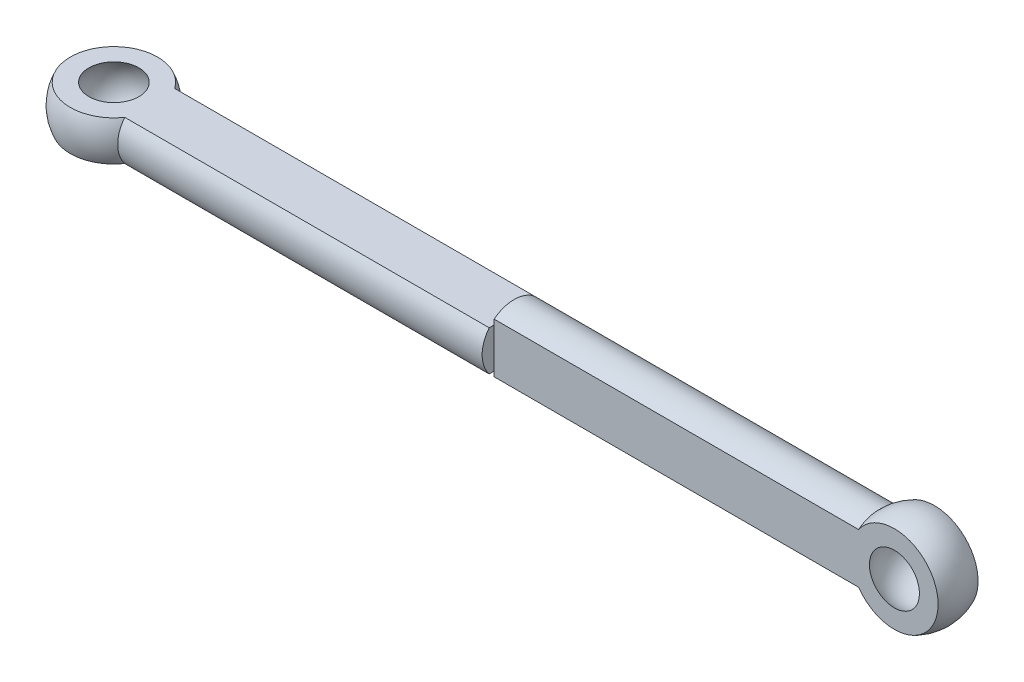
ISO-10303-21;
HEADER;
FILE_DESCRIPTION(('STEP AP214'),'2;1');
FILE_NAME('part.step','',(''),(''),'','','');
FILE_SCHEMA(('AUTOMOTIVE_DESIGN { 1 0 10303 214 1 1 1 1 }'));
ENDSEC;
DATA;
#1=APPLICATION_CONTEXT('core data for automotive mechanical design processes');
#2=APPLICATION_PROTOCOL_DEFINITION('international standard','automotive_design',2000,#1);
#3=PRODUCT_CONTEXT('',#1,'mechanical');
#4=PRODUCT('Part','Part','',(#3));
#5=PRODUCT_RELATED_PRODUCT_CATEGORY('part','',(#4));
#6=PRODUCT_DEFINITION_FORMATION('','',#4);
#7=PRODUCT_DEFINITION_CONTEXT('part definition',#1,'design');
#8=PRODUCT_DEFINITION('design','',#6,#7);
#9=PRODUCT_DEFINITION_SHAPE('','',#8);
#10=(LENGTH_UNIT() NAMED_UNIT(*) SI_UNIT(.MILLI.,.METRE.));
#11=(NAMED_UNIT(*) PLANE_ANGLE_UNIT() SI_UNIT($,.RADIAN.));
#12=(NAMED_UNIT(*) SI_UNIT($,.STERADIAN.) SOLID_ANGLE_UNIT());
#13=UNCERTAINTY_MEASURE_WITH_UNIT(LENGTH_MEASURE(1.E-05),#10,'distance_accuracy_value','');
#14=(GEOMETRIC_REPRESENTATION_CONTEXT(3) GLOBAL_UNCERTAINTY_ASSIGNED_CONTEXT((#13)) GLOBAL_UNIT_ASSIGNED_CONTEXT((#10,
#11,#12)) REPRESENTATION_CONTEXT('',''));
#15=CARTESIAN_POINT('',(0.,0.,0.));
#16=DIRECTION('',(0.,0.,1.));
#17=DIRECTION('',(1.,0.,0.));
#18=AXIS2_PLACEMENT_3D('',#15,#16,#17);
#19=CARTESIAN_POINT('',(0.,0.,0.));
#20=DIRECTION('',(1.,0.,0.));
#21=DIRECTION('',(0.,0.,-1.));
#22=AXIS2_PLACEMENT_3D('',#19,#20,#21);
#23=CYLINDRICAL_SURFACE('',#22,2.);
#24=CARTESIAN_POINT('',(0.,0.,0.));
#25=DIRECTION('',(1.,0.,0.));
#26=DIRECTION('',(0.,0.,-1.));
#27=AXIS2_PLACEMENT_3D('',#24,#25,#26);
#28=CIRCLE('',#27,2.);
#29=CARTESIAN_POINT('',(0.,1.25,1.5612494995996));
#30=VERTEX_POINT('',#29);
#31=CARTESIAN_POINT('',(0.,-1.25,1.5612494995996));
#32=VERTEX_POINT('',#31);
#33=EDGE_CURVE('E171',#30,#32,#28,.T.);
#34=ORIENTED_EDGE('',*,*,#33,.F.);
#35=DIRECTION('',(1.,0.,0.));
#36=VECTOR('',#35,1.);
#37=CARTESIAN_POINT('',(0.,1.25,1.5612494995996));
#38=LINE('',#37,#36);
#39=CARTESIAN_POINT('',(-22.7639320225002,1.25,1.5612494995996));
#40=VERTEX_POINT('',#39);
#41=EDGE_CURVE('E186',#40,#30,#38,.T.);
#42=ORIENTED_EDGE('',*,*,#41,.F.);
#43=CARTESIAN_POINT('',(-22.7639320225002,0.,0.));
#44=DIRECTION('',(1.,0.,0.));
#45=DIRECTION('',(0.,0.,-1.));
#46=AXIS2_PLACEMENT_3D('',#43,#44,#45);
#47=CIRCLE('',#46,2.);
#48=CARTESIAN_POINT('',(-22.7639320225002,-1.25,1.5612494995996));
#49=VERTEX_POINT('',#48);
#50=EDGE_CURVE('E149',#40,#49,#47,.T.);
#51=ORIENTED_EDGE('',*,*,#50,.T.);
#52=DIRECTION('',(1.,0.,0.));
#53=VECTOR('',#52,1.);
#54=CARTESIAN_POINT('',(0.,-1.25,1.5612494995996));
#55=LINE('',#54,#53);
#56=EDGE_CURVE('E189',#32,#49,#55,.F.);
#57=ORIENTED_EDGE('',*,*,#56,.F.);
#58=EDGE_LOOP('',(#34,#42,#51,#57));
#59=FACE_BOUND('',#58,.T.);
#60=ADVANCED_FACE('F36',(#59),#23,.T.);
#61=CARTESIAN_POINT('',(0.,-1.25,-1.5612494995996));
#62=VERTEX_POINT('',#61);
#63=CARTESIAN_POINT('',(0.,1.25,-1.5612494995996));
#64=VERTEX_POINT('',#63);
#65=EDGE_CURVE('E170',#62,#64,#28,.T.);
#66=ORIENTED_EDGE('',*,*,#65,.F.);
#67=DIRECTION('',(1.,0.,0.));
#68=VECTOR('',#67,1.);
#69=CARTESIAN_POINT('',(0.,-1.25,-1.5612494995996));
#70=LINE('',#69,#68);
#71=CARTESIAN_POINT('',(-22.7639320225002,-1.25,-1.56124949959959));
#72=VERTEX_POINT('',#71);
#73=EDGE_CURVE('E193',#72,#62,#70,.T.);
#74=ORIENTED_EDGE('',*,*,#73,.F.);
#75=CARTESIAN_POINT('',(-22.7639320225002,1.25,-1.5612494995996));
#76=VERTEX_POINT('',#75);
#77=EDGE_CURVE('E151',#72,#76,#47,.T.);
#78=ORIENTED_EDGE('',*,*,#77,.T.);
#79=DIRECTION('',(1.,0.,0.));
#80=VECTOR('',#79,1.);
#81=CARTESIAN_POINT('',(0.,1.25,-1.5612494995996));
#82=LINE('',#81,#80);
#83=EDGE_CURVE('E182',#64,#76,#82,.F.);
#84=ORIENTED_EDGE('',*,*,#83,.F.);
#85=EDGE_LOOP('',(#66,#74,#78,#84));
#86=FACE_BOUND('',#85,.T.);
#87=ADVANCED_FACE('F226',(#86),#23,.T.);
#88=CARTESIAN_POINT('',(0.,0.,0.));
#89=DIRECTION('',(1.,0.,0.));
#90=DIRECTION('',(0.,0.,-1.));
#91=AXIS2_PLACEMENT_3D('',#88,#89,#90);
#92=CIRCLE('',#91,2.);
#93=CARTESIAN_POINT('',(0.,-1.5612494995996,1.25));
#94=VERTEX_POINT('',#93);
#95=CARTESIAN_POINT('',(0.,-1.5612494995996,-1.25));
#96=VERTEX_POINT('',#95);
#97=EDGE_CURVE('E12',#94,#96,#92,.T.);
#98=ORIENTED_EDGE('',*,*,#97,.T.);
#99=DIRECTION('',(1.,0.,0.));
#100=VECTOR('',#99,1.);
#101=CARTESIAN_POINT('',(0.,-1.5612494995996,-1.25));
#102=LINE('',#101,#100);
#103=CARTESIAN_POINT('',(22.7639320225002,-1.56124949959959,-1.25));
#104=VERTEX_POINT('',#103);
#105=EDGE_CURVE('E167',#96,#104,#102,.T.);
#106=ORIENTED_EDGE('',*,*,#105,.T.);
#107=CARTESIAN_POINT('',(22.7639320225002,0.,0.));
#108=DIRECTION('',(1.,0.,0.));
#109=DIRECTION('',(0.,0.,-1.));
#110=AXIS2_PLACEMENT_3D('',#107,#108,#109);
#111=CIRCLE('',#110,2.);
#112=CARTESIAN_POINT('',(22.7639320225002,-1.5612494995996,1.25));
#113=VERTEX_POINT('',#112);
#114=EDGE_CURVE('E196',#113,#104,#111,.T.);
#115=ORIENTED_EDGE('',*,*,#114,.F.);
#116=DIRECTION('',(1.,0.,0.));
#117=VECTOR('',#116,1.);
#118=CARTESIAN_POINT('',(0.,-1.5612494995996,1.25));
#119=LINE('',#118,#117);
#120=EDGE_CURVE('E133',#113,#94,#119,.F.);
#121=ORIENTED_EDGE('',*,*,#120,.T.);
#122=EDGE_LOOP('',(#98,#106,#115,#121));
#123=FACE_BOUND('',#122,.T.);
#124=ADVANCED_FACE('F252',(#123),#23,.T.);
#125=CARTESIAN_POINT('',(-25.,0.,0.));
#126=DIRECTION('',(1.,0.,0.));
#127=DIRECTION('',(0.,0.,-1.));
#128=AXIS2_PLACEMENT_3D('',#125,#126,#127);
#129=SPHERICAL_SURFACE('',#128,3.);
#130=CARTESIAN_POINT('',(-25.,0.,-3.));
#131=VERTEX_POINT('',#130);
#132=VERTEX_LOOP('',#131);
#133=FACE_BOUND('',#132,.T.);
#134=CARTESIAN_POINT('',(-25.,0.,3.));
#135=VERTEX_POINT('',#134);
#136=VERTEX_LOOP('',#135);
#137=FACE_BOUND('',#136,.T.);
#138=CARTESIAN_POINT('',(-25.,-1.25,0.));
#139=DIRECTION('',(0.,-1.,0.));
#140=DIRECTION('',(0.,0.,-1.));
#141=AXIS2_PLACEMENT_3D('',#138,#139,#140);
#142=CIRCLE('',#141,2.72717802865893);
#143=EDGE_CURVE('E191',#49,#72,#142,.T.);
#144=ORIENTED_EDGE('',*,*,#143,.F.);
#145=ORIENTED_EDGE('',*,*,#50,.F.);
#146=CARTESIAN_POINT('',(-25.,1.25,0.));
#147=DIRECTION('',(0.,1.,0.));
#148=DIRECTION('',(0.,0.,1.));
#149=AXIS2_PLACEMENT_3D('',#146,#147,#148);
#150=CIRCLE('',#149,2.72717802865893);
#151=EDGE_CURVE('E184',#76,#40,#150,.T.);
#152=ORIENTED_EDGE('',*,*,#151,.F.);
#153=ORIENTED_EDGE('',*,*,#77,.F.);
#154=EDGE_LOOP('',(#144,#145,#152,#153));
#155=FACE_BOUND('',#154,.T.);
#156=ADVANCED_FACE('F38',(#133,#137,#155),#129,.T.);
#157=CARTESIAN_POINT('',(22.7639320225002,1.56124949959959,-1.25));
#158=VERTEX_POINT('',#157);
#159=CARTESIAN_POINT('',(22.7639320225002,1.56124949959959,1.25));
#160=VERTEX_POINT('',#159);
#161=EDGE_CURVE('E197',#158,#160,#111,.T.);
#162=ORIENTED_EDGE('',*,*,#161,.F.);
#163=DIRECTION('',(1.,0.,0.));
#164=VECTOR('',#163,1.);
#165=CARTESIAN_POINT('',(0.,1.5612494995996,-1.25));
#166=LINE('',#165,#164);
#167=CARTESIAN_POINT('',(0.,1.5612494995996,-1.25));
#168=VERTEX_POINT('',#167);
#169=EDGE_CURVE('E148',#158,#168,#166,.F.);
#170=ORIENTED_EDGE('',*,*,#169,.T.);
#171=CARTESIAN_POINT('',(0.,1.5612494995996,1.25));
#172=VERTEX_POINT('',#171);
#173=EDGE_CURVE('E45',#168,#172,#92,.T.);
#174=ORIENTED_EDGE('',*,*,#173,.T.);
#175=DIRECTION('',(1.,0.,0.));
#176=VECTOR('',#175,1.);
#177=CARTESIAN_POINT('',(0.,1.5612494995996,1.25));
#178=LINE('',#177,#176);
#179=EDGE_CURVE('E121',#172,#160,#178,.T.);
#180=ORIENTED_EDGE('',*,*,#179,.T.);
#181=EDGE_LOOP('',(#162,#170,#174,#180));
#182=FACE_BOUND('',#181,.T.);
#183=ADVANCED_FACE('F147',(#182),#23,.T.);
#184=CARTESIAN_POINT('',(25.,0.,0.));
#185=DIRECTION('',(1.,0.,0.));
#186=DIRECTION('',(0.,0.,1.));
#187=AXIS2_PLACEMENT_3D('',#184,#185,#186);
#188=SPHERICAL_SURFACE('',#187,3.);
#189=CARTESIAN_POINT('',(25.,3.,0.));
#190=VERTEX_POINT('',#189);
#191=VERTEX_LOOP('',#190);
#192=FACE_BOUND('',#191,.T.);
#193=CARTESIAN_POINT('',(25.,-3.,0.));
#194=VERTEX_POINT('',#193);
#195=VERTEX_LOOP('',#194);
#196=FACE_BOUND('',#195,.T.);
#197=CARTESIAN_POINT('',(25.,0.,-1.25));
#198=DIRECTION('',(0.,0.,1.));
#199=DIRECTION('',(0.,-1.,0.));
#200=AXIS2_PLACEMENT_3D('',#197,#198,#199);
#201=CIRCLE('',#200,2.72717802865893);
#202=EDGE_CURVE('E164',#158,#104,#201,.F.);
#203=ORIENTED_EDGE('',*,*,#202,.F.);
#204=ORIENTED_EDGE('',*,*,#161,.T.);
#205=CARTESIAN_POINT('',(25.,0.,1.25));
#206=DIRECTION('',(0.,0.,-1.));
#207=DIRECTION('',(0.,1.,0.));
#208=AXIS2_PLACEMENT_3D('',#205,#206,#207);
#209=CIRCLE('',#208,2.72717802865893);
#210=EDGE_CURVE('E128',#113,#160,#209,.F.);
#211=ORIENTED_EDGE('',*,*,#210,.F.);
#212=ORIENTED_EDGE('',*,*,#114,.T.);
#213=EDGE_LOOP('',(#203,#204,#211,#212));
#214=FACE_BOUND('',#213,.T.);
#215=ADVANCED_FACE('F208',(#192,#196,#214),#188,.T.);
#216=CARTESIAN_POINT('',(-60.,1.25,3.));
#217=DIRECTION('',(0.,1.,0.));
#218=DIRECTION('',(0.,0.,1.));
#219=AXIS2_PLACEMENT_3D('',#216,#217,#218);
#220=PLANE('',#219);
#221=CARTESIAN_POINT('',(-25.,1.25,0.));
#222=DIRECTION('',(0.,1.,0.));
#223=DIRECTION('',(0.,0.,1.));
#224=AXIS2_PLACEMENT_3D('',#221,#222,#223);
#225=CIRCLE('',#224,1.5612494995996);
#226=CARTESIAN_POINT('',(-25.,1.25,1.56124949959961));
#227=VERTEX_POINT('',#226);
#228=EDGE_CURVE('E180',#227,#227,#225,.T.);
#229=ORIENTED_EDGE('',*,*,#228,.F.);
#230=EDGE_LOOP('',(#229));
#231=FACE_BOUND('',#230,.T.);
#232=ORIENTED_EDGE('',*,*,#41,.T.);
#233=DIRECTION('',(0.,0.,-1.));
#234=VECTOR('',#233,1.);
#235=CARTESIAN_POINT('',(0.,1.25,3.));
#236=LINE('',#235,#234);
#237=CARTESIAN_POINT('',(0.,1.25,1.25));
#238=VERTEX_POINT('',#237);
#239=EDGE_CURVE('E173',#30,#238,#236,.T.);
#240=ORIENTED_EDGE('',*,*,#239,.T.);
#241=DIRECTION('',(0.,0.,1.));
#242=VECTOR('',#241,1.);
#243=CARTESIAN_POINT('',(0.,1.25,3.));
#244=LINE('',#243,#242);
#245=CARTESIAN_POINT('',(0.,1.25,-1.25));
#246=VERTEX_POINT('',#245);
#247=EDGE_CURVE('E141',#246,#238,#244,.T.);
#248=ORIENTED_EDGE('',*,*,#247,.F.);
#249=EDGE_CURVE('E175',#64,#246,#244,.T.);
#250=ORIENTED_EDGE('',*,*,#249,.F.);
#251=ORIENTED_EDGE('',*,*,#83,.T.);
#252=ORIENTED_EDGE('',*,*,#151,.T.);
#253=EDGE_LOOP('',(#232,#240,#248,#250,#251,#252));
#254=FACE_BOUND('',#253,.T.);
#255=ADVANCED_FACE('F205',(#231,#254),#220,.T.);
#256=CARTESIAN_POINT('',(0.,0.,0.));
#257=DIRECTION('',(1.,0.,0.));
#258=DIRECTION('',(0.,0.,-1.));
#259=AXIS2_PLACEMENT_3D('',#256,#257,#258);
#260=PLANE('',#259);
#261=ORIENTED_EDGE('',*,*,#173,.F.);
#262=DIRECTION('',(0.,1.,0.));
#263=VECTOR('',#262,1.);
#264=CARTESIAN_POINT('',(0.,3.,-1.25));
#265=LINE('',#264,#263);
#266=EDGE_CURVE('E244',#246,#168,#265,.T.);
#267=ORIENTED_EDGE('',*,*,#266,.F.);
#268=ORIENTED_EDGE('',*,*,#247,.T.);
#269=DIRECTION('',(0.,-1.,0.));
#270=VECTOR('',#269,1.);
#271=CARTESIAN_POINT('',(0.,3.,1.25));
#272=LINE('',#271,#270);
#273=EDGE_CURVE('E125',#172,#238,#272,.T.);
#274=ORIENTED_EDGE('',*,*,#273,.F.);
#275=EDGE_LOOP('',(#261,#267,#268,#274));
#276=FACE_BOUND('',#275,.T.);
#277=ADVANCED_FACE('F138',(#276),#260,.F.);
#278=DIRECTION('',(0.,0.,-1.));
#279=VECTOR('',#278,1.);
#280=CARTESIAN_POINT('',(0.,-1.25,3.));
#281=LINE('',#280,#279);
#282=CARTESIAN_POINT('',(0.,-1.25,1.25));
#283=VERTEX_POINT('',#282);
#284=CARTESIAN_POINT('',(0.,-1.25,-1.25));
#285=VERTEX_POINT('',#284);
#286=EDGE_CURVE('E181',#283,#285,#281,.T.);
#287=ORIENTED_EDGE('',*,*,#286,.T.);
#288=EDGE_CURVE('E241',#96,#285,#265,.T.);
#289=ORIENTED_EDGE('',*,*,#288,.F.);
#290=ORIENTED_EDGE('',*,*,#97,.F.);
#291=EDGE_CURVE('E145',#283,#94,#272,.T.);
#292=ORIENTED_EDGE('',*,*,#291,.F.);
#293=EDGE_LOOP('',(#287,#289,#290,#292));
#294=FACE_BOUND('',#293,.T.);
#295=ADVANCED_FACE('F239',(#294),#260,.F.);
#296=CARTESIAN_POINT('',(-60.,-1.25,3.));
#297=DIRECTION('',(0.,-1.,0.));
#298=DIRECTION('',(0.,0.,-1.));
#299=AXIS2_PLACEMENT_3D('',#296,#297,#298);
#300=PLANE('',#299);
#301=CARTESIAN_POINT('',(-25.,-1.25,0.));
#302=DIRECTION('',(0.,-1.,0.));
#303=DIRECTION('',(0.,0.,-1.));
#304=AXIS2_PLACEMENT_3D('',#301,#302,#303);
#305=CIRCLE('',#304,1.5612494995996);
#306=CARTESIAN_POINT('',(-25.,-1.25,-1.5612494995996));
#307=VERTEX_POINT('',#306);
#308=EDGE_CURVE('E154',#307,#307,#305,.T.);
#309=ORIENTED_EDGE('',*,*,#308,.F.);
#310=EDGE_LOOP('',(#309));
#311=FACE_BOUND('',#310,.T.);
#312=ORIENTED_EDGE('',*,*,#73,.T.);
#313=EDGE_CURVE('E177',#285,#62,#281,.T.);
#314=ORIENTED_EDGE('',*,*,#313,.F.);
#315=ORIENTED_EDGE('',*,*,#286,.F.);
#316=EDGE_CURVE('E178',#32,#283,#281,.T.);
#317=ORIENTED_EDGE('',*,*,#316,.F.);
#318=ORIENTED_EDGE('',*,*,#56,.T.);
#319=ORIENTED_EDGE('',*,*,#143,.T.);
#320=EDGE_LOOP('',(#312,#314,#315,#317,#318,#319));
#321=FACE_BOUND('',#320,.T.);
#322=ADVANCED_FACE('F221',(#311,#321),#300,.T.);
#323=CARTESIAN_POINT('',(-25.,0.,0.));
#324=DIRECTION('',(1.,0.,0.));
#325=DIRECTION('',(0.,0.,-1.));
#326=AXIS2_PLACEMENT_3D('',#323,#324,#325);
#327=SPHERICAL_SURFACE('',#326,2.);
#328=CARTESIAN_POINT('',(-25.,0.,0.));
#329=DIRECTION('',(0.,1.,0.));
#330=DIRECTION('',(0.,0.,1.));
#331=AXIS2_PLACEMENT_3D('',#328,#329,#330);
#332=SPHERICAL_SURFACE('',#331,2.);
#333=ORIENTED_EDGE('',*,*,#228,.T.);
#334=EDGE_LOOP('',(#333));
#335=FACE_BOUND('',#334,.T.);
#336=ORIENTED_EDGE('',*,*,#308,.T.);
#337=EDGE_LOOP('',(#336));
#338=FACE_BOUND('',#337,.T.);
#339=ADVANCED_FACE('F202',(#335,#338),#332,.F.);
#340=CARTESIAN_POINT('',(28.,3.,1.25));
#341=DIRECTION('',(0.,0.,-1.));
#342=DIRECTION('',(0.,1.,0.));
#343=AXIS2_PLACEMENT_3D('',#340,#341,#342);
#344=PLANE('',#343);
#345=CARTESIAN_POINT('',(25.,0.,1.25));
#346=DIRECTION('',(0.,0.,-1.));
#347=DIRECTION('',(0.,1.,0.));
#348=AXIS2_PLACEMENT_3D('',#345,#346,#347);
#349=CIRCLE('',#348,1.5612494995996);
#350=CARTESIAN_POINT('',(25.,1.5612494995996,1.25));
#351=VERTEX_POINT('',#350);
#352=EDGE_CURVE('E142',#351,#351,#349,.F.);
#353=ORIENTED_EDGE('',*,*,#352,.F.);
#354=EDGE_LOOP('',(#353));
#355=FACE_BOUND('',#354,.T.);
#356=ORIENTED_EDGE('',*,*,#273,.T.);
#357=EDGE_CURVE('E143',#238,#283,#272,.T.);
#358=ORIENTED_EDGE('',*,*,#357,.T.);
#359=ORIENTED_EDGE('',*,*,#291,.T.);
#360=ORIENTED_EDGE('',*,*,#120,.F.);
#361=ORIENTED_EDGE('',*,*,#210,.T.);
#362=ORIENTED_EDGE('',*,*,#179,.F.);
#363=EDGE_LOOP('',(#356,#358,#359,#360,#361,#362));
#364=FACE_BOUND('',#363,.T.);
#365=ADVANCED_FACE('F123',(#355,#364),#344,.F.);
#366=CARTESIAN_POINT('',(0.,0.,0.));
#367=DIRECTION('',(1.,0.,0.));
#368=DIRECTION('',(0.,0.,-1.));
#369=AXIS2_PLACEMENT_3D('',#366,#367,#368);
#370=PLANE('',#369);
#371=ORIENTED_EDGE('',*,*,#33,.T.);
#372=ORIENTED_EDGE('',*,*,#316,.T.);
#373=ORIENTED_EDGE('',*,*,#357,.F.);
#374=ORIENTED_EDGE('',*,*,#239,.F.);
#375=EDGE_LOOP('',(#371,#372,#373,#374));
#376=FACE_BOUND('',#375,.T.);
#377=ADVANCED_FACE('F243',(#376),#370,.T.);
#378=EDGE_CURVE('E233',#285,#246,#265,.T.);
#379=ORIENTED_EDGE('',*,*,#378,.F.);
#380=ORIENTED_EDGE('',*,*,#313,.T.);
#381=ORIENTED_EDGE('',*,*,#65,.T.);
#382=ORIENTED_EDGE('',*,*,#249,.T.);
#383=EDGE_LOOP('',(#379,#380,#381,#382));
#384=FACE_BOUND('',#383,.T.);
#385=ADVANCED_FACE('F231',(#384),#370,.T.);
#386=CARTESIAN_POINT('',(28.,3.,-1.25));
#387=DIRECTION('',(0.,0.,1.));
#388=DIRECTION('',(0.,-1.,0.));
#389=AXIS2_PLACEMENT_3D('',#386,#387,#388);
#390=PLANE('',#389);
#391=CARTESIAN_POINT('',(25.,0.,-1.25));
#392=DIRECTION('',(0.,0.,1.));
#393=DIRECTION('',(0.,-1.,0.));
#394=AXIS2_PLACEMENT_3D('',#391,#392,#393);
#395=CIRCLE('',#394,1.5612494995996);
#396=CARTESIAN_POINT('',(25.,-1.5612494995996,-1.25));
#397=VERTEX_POINT('',#396);
#398=EDGE_CURVE('E40',#397,#397,#395,.F.);
#399=ORIENTED_EDGE('',*,*,#398,.F.);
#400=EDGE_LOOP('',(#399));
#401=FACE_BOUND('',#400,.T.);
#402=ORIENTED_EDGE('',*,*,#288,.T.);
#403=ORIENTED_EDGE('',*,*,#378,.T.);
#404=ORIENTED_EDGE('',*,*,#266,.T.);
#405=ORIENTED_EDGE('',*,*,#169,.F.);
#406=ORIENTED_EDGE('',*,*,#202,.T.);
#407=ORIENTED_EDGE('',*,*,#105,.F.);
#408=EDGE_LOOP('',(#402,#403,#404,#405,#406,#407));
#409=FACE_BOUND('',#408,.T.);
#410=ADVANCED_FACE('F246',(#401,#409),#390,.F.);
#411=CARTESIAN_POINT('',(25.,0.,0.));
#412=DIRECTION('',(1.,0.,0.));
#413=DIRECTION('',(0.,0.,1.));
#414=AXIS2_PLACEMENT_3D('',#411,#412,#413);
#415=SPHERICAL_SURFACE('',#414,2.);
#416=CARTESIAN_POINT('',(25.,0.,0.));
#417=DIRECTION('',(0.,0.,1.));
#418=DIRECTION('',(0.,-1.,0.));
#419=AXIS2_PLACEMENT_3D('',#416,#417,#418);
#420=SPHERICAL_SURFACE('',#419,2.);
#421=ORIENTED_EDGE('',*,*,#398,.T.);
#422=EDGE_LOOP('',(#421));
#423=FACE_BOUND('',#422,.T.);
#424=ORIENTED_EDGE('',*,*,#352,.T.);
#425=EDGE_LOOP('',(#424));
#426=FACE_BOUND('',#425,.T.);
#427=ADVANCED_FACE('F353',(#423,#426),#420,.F.);
#428=CLOSED_SHELL('',(#60,#87,#124,#156,#183,#215,#255,#277,#295,#322,#339,#365,#377,#385,#410,#427));
#429=MANIFOLD_SOLID_BREP('B2',#428);
#430=ADVANCED_BREP_SHAPE_REPRESENTATION('',(#18,#429),#14);
#431=SHAPE_DEFINITION_REPRESENTATION(#9,#430);
ENDSEC;
END-ISO-10303-21;
